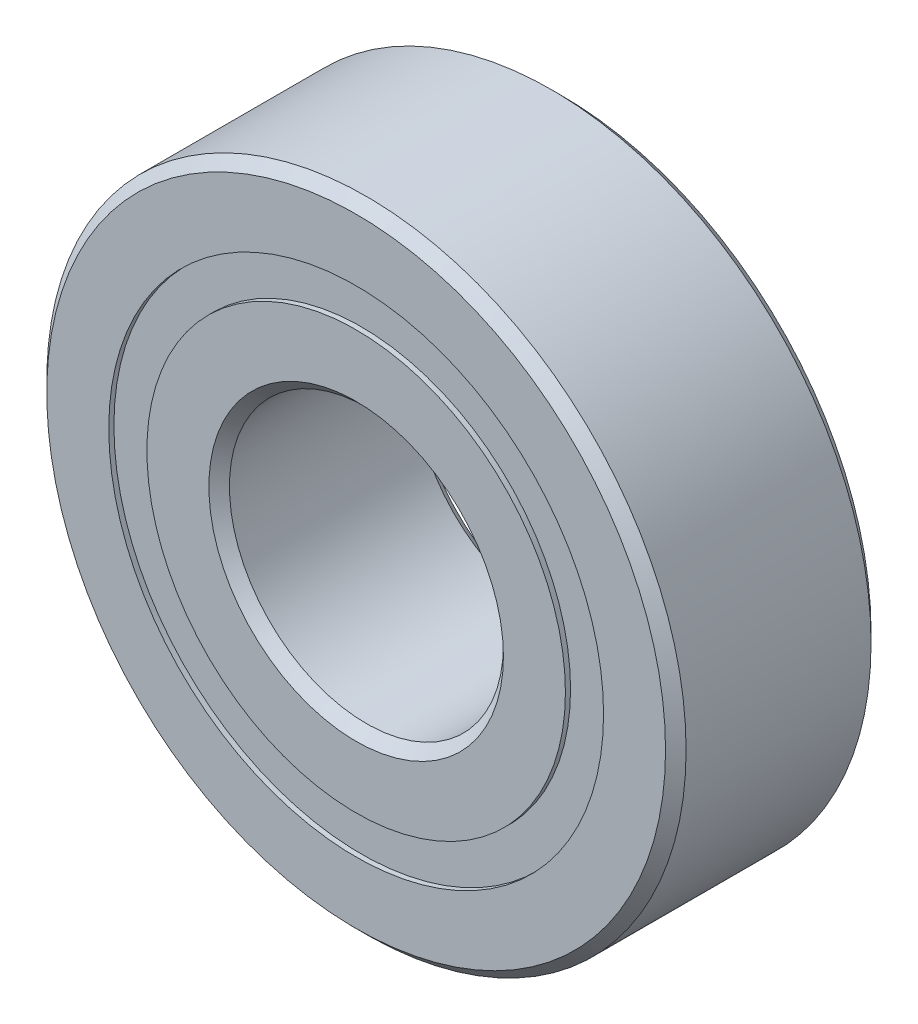
ISO-10303-21;
HEADER;
FILE_DESCRIPTION(('STEP AP214'),'2;1');
FILE_NAME('part.step','',(''),(''),'','','');
FILE_SCHEMA(('AUTOMOTIVE_DESIGN { 1 0 10303 214 1 1 1 1 }'));
ENDSEC;
DATA;
#1=APPLICATION_CONTEXT('core data for automotive mechanical design processes');
#2=APPLICATION_PROTOCOL_DEFINITION('international standard','automotive_design',2000,#1);
#3=PRODUCT_CONTEXT('',#1,'mechanical');
#4=PRODUCT('Part','Part','',(#3));
#5=PRODUCT_RELATED_PRODUCT_CATEGORY('part','',(#4));
#6=PRODUCT_DEFINITION_FORMATION('','',#4);
#7=PRODUCT_DEFINITION_CONTEXT('part definition',#1,'design');
#8=PRODUCT_DEFINITION('design','',#6,#7);
#9=PRODUCT_DEFINITION_SHAPE('','',#8);
#10=(LENGTH_UNIT() NAMED_UNIT(*) SI_UNIT(.MILLI.,.METRE.));
#11=(NAMED_UNIT(*) PLANE_ANGLE_UNIT() SI_UNIT($,.RADIAN.));
#12=(NAMED_UNIT(*) SI_UNIT($,.STERADIAN.) SOLID_ANGLE_UNIT());
#13=UNCERTAINTY_MEASURE_WITH_UNIT(LENGTH_MEASURE(1.E-05),#10,'distance_accuracy_value','');
#14=(GEOMETRIC_REPRESENTATION_CONTEXT(3) GLOBAL_UNCERTAINTY_ASSIGNED_CONTEXT((#13)) GLOBAL_UNIT_ASSIGNED_CONTEXT((#10,
#11,#12)) REPRESENTATION_CONTEXT('',''));
#15=CARTESIAN_POINT('',(0.,0.,0.));
#16=DIRECTION('',(0.,0.,1.));
#17=DIRECTION('',(1.,0.,0.));
#18=AXIS2_PLACEMENT_3D('',#15,#16,#17);
#19=CARTESIAN_POINT('',(0.,8.60041208791209,-3.39328125));
#20=DIRECTION('',(0.,0.,1.));
#21=DIRECTION('',(1.,0.,0.));
#22=AXIS2_PLACEMENT_3D('',#19,#20,#21);
#23=PLANE('',#22);
#24=CARTESIAN_POINT('',(0.,0.,-3.39328125));
#25=DIRECTION('',(0.,0.,1.));
#26=DIRECTION('',(1.,0.,0.));
#27=AXIS2_PLACEMENT_3D('',#24,#25,#26);
#28=CIRCLE('',#27,8.60041208791209);
#29=CARTESIAN_POINT('',(8.60041208791209,0.,-3.39328125));
#30=VERTEX_POINT('',#29);
#31=EDGE_CURVE('E67',#30,#30,#28,.T.);
#32=ORIENTED_EDGE('',*,*,#31,.F.);
#33=EDGE_LOOP('',(#32));
#34=FACE_BOUND('',#33,.T.);
#35=CARTESIAN_POINT('',(0.,0.,-3.39328125));
#36=DIRECTION('',(0.,0.,1.));
#37=DIRECTION('',(1.,0.,0.));
#38=AXIS2_PLACEMENT_3D('',#35,#36,#37);
#39=CIRCLE('',#38,7.27458791208791);
#40=CARTESIAN_POINT('',(7.27458791208791,0.,-3.39328125));
#41=VERTEX_POINT('',#40);
#42=EDGE_CURVE('E13',#41,#41,#39,.T.);
#43=ORIENTED_EDGE('',*,*,#42,.T.);
#44=EDGE_LOOP('',(#43));
#45=FACE_BOUND('',#44,.T.);
#46=ADVANCED_FACE('F53',(#34,#45),#23,.F.);
#47=CARTESIAN_POINT('',(0.,0.,3.571875));
#48=DIRECTION('',(0.,0.,1.));
#49=DIRECTION('',(1.,0.,0.));
#50=AXIS2_PLACEMENT_3D('',#47,#48,#49);
#51=CYLINDRICAL_SURFACE('',#50,7.27458791208791);
#52=ORIENTED_EDGE('',*,*,#42,.F.);
#53=EDGE_LOOP('',(#52));
#54=FACE_BOUND('',#53,.T.);
#55=CARTESIAN_POINT('',(0.,0.,-1.72035132641561));
#56=DIRECTION('',(0.,0.,1.));
#57=DIRECTION('',(1.,0.,0.));
#58=AXIS2_PLACEMENT_3D('',#55,#56,#57);
#59=CIRCLE('',#58,7.27458791208791);
#60=CARTESIAN_POINT('',(7.27458791208791,0.,-1.72035132641561));
#61=VERTEX_POINT('',#60);
#62=EDGE_CURVE('E59',#61,#61,#59,.T.);
#63=ORIENTED_EDGE('',*,*,#62,.T.);
#64=EDGE_LOOP('',(#63));
#65=FACE_BOUND('',#64,.T.);
#66=ADVANCED_FACE('F76',(#54,#65),#51,.F.);
#67=CARTESIAN_POINT('',(0.,8.60041208791209,-1.72035132641561));
#68=DIRECTION('',(0.,0.,-1.));
#69=DIRECTION('',(-1.,0.,0.));
#70=AXIS2_PLACEMENT_3D('',#67,#68,#69);
#71=PLANE('',#70);
#72=ORIENTED_EDGE('',*,*,#62,.F.);
#73=EDGE_LOOP('',(#72));
#74=FACE_BOUND('',#73,.T.);
#75=CARTESIAN_POINT('',(0.,0.,-1.72035132641561));
#76=DIRECTION('',(0.,0.,1.));
#77=DIRECTION('',(1.,0.,0.));
#78=AXIS2_PLACEMENT_3D('',#75,#76,#77);
#79=CIRCLE('',#78,8.60041208791209);
#80=CARTESIAN_POINT('',(8.60041208791209,0.,-1.72035132641561));
#81=VERTEX_POINT('',#80);
#82=EDGE_CURVE('E63',#81,#81,#79,.T.);
#83=ORIENTED_EDGE('',*,*,#82,.T.);
#84=EDGE_LOOP('',(#83));
#85=FACE_BOUND('',#84,.T.);
#86=ADVANCED_FACE('F80',(#74,#85),#71,.F.);
#87=CARTESIAN_POINT('',(0.,0.,3.571875));
#88=DIRECTION('',(0.,0.,1.));
#89=DIRECTION('',(1.,0.,0.));
#90=AXIS2_PLACEMENT_3D('',#87,#88,#89);
#91=CYLINDRICAL_SURFACE('',#90,8.60041208791209);
#92=ORIENTED_EDGE('',*,*,#82,.F.);
#93=EDGE_LOOP('',(#92));
#94=FACE_BOUND('',#93,.T.);
#95=ORIENTED_EDGE('',*,*,#31,.T.);
#96=EDGE_LOOP('',(#95));
#97=FACE_BOUND('',#96,.T.);
#98=ADVANCED_FACE('F73',(#94,#97),#91,.T.);
#99=CLOSED_SHELL('',(#46,#66,#86,#98));
#100=MANIFOLD_SOLID_BREP('B2',#99);
#101=CARTESIAN_POINT('',(0.,8.60041208791209,3.39328125));
#102=DIRECTION('',(0.,0.,-1.));
#103=DIRECTION('',(-1.,0.,0.));
#104=AXIS2_PLACEMENT_3D('',#101,#102,#103);
#105=PLANE('',#104);
#106=CARTESIAN_POINT('',(0.,0.,3.39328125));
#107=DIRECTION('',(0.,0.,1.));
#108=DIRECTION('',(1.,0.,0.));
#109=AXIS2_PLACEMENT_3D('',#106,#107,#108);
#110=CIRCLE('',#109,7.27458791208791);
#111=CARTESIAN_POINT('',(7.27458791208791,0.,3.39328125));
#112=VERTEX_POINT('',#111);
#113=EDGE_CURVE('E52',#112,#112,#110,.T.);
#114=ORIENTED_EDGE('',*,*,#113,.F.);
#115=EDGE_LOOP('',(#114));
#116=FACE_BOUND('',#115,.T.);
#117=CARTESIAN_POINT('',(0.,0.,3.39328125));
#118=DIRECTION('',(0.,0.,1.));
#119=DIRECTION('',(1.,0.,0.));
#120=AXIS2_PLACEMENT_3D('',#117,#118,#119);
#121=CIRCLE('',#120,8.60041208791209);
#122=CARTESIAN_POINT('',(8.60041208791209,0.,3.39328125));
#123=VERTEX_POINT('',#122);
#124=EDGE_CURVE('E140',#123,#123,#121,.T.);
#125=ORIENTED_EDGE('',*,*,#124,.T.);
#126=EDGE_LOOP('',(#125));
#127=FACE_BOUND('',#126,.T.);
#128=ADVANCED_FACE('F126',(#116,#127),#105,.F.);
#129=CARTESIAN_POINT('',(0.,0.,3.571875));
#130=DIRECTION('',(0.,0.,1.));
#131=DIRECTION('',(1.,0.,0.));
#132=AXIS2_PLACEMENT_3D('',#129,#130,#131);
#133=CYLINDRICAL_SURFACE('',#132,7.27458791208791);
#134=CARTESIAN_POINT('',(0.,0.,1.72035132641561));
#135=DIRECTION('',(0.,0.,1.));
#136=DIRECTION('',(1.,0.,0.));
#137=AXIS2_PLACEMENT_3D('',#134,#135,#136);
#138=CIRCLE('',#137,7.27458791208791);
#139=CARTESIAN_POINT('',(7.27458791208791,0.,1.72035132641561));
#140=VERTEX_POINT('',#139);
#141=EDGE_CURVE('E132',#140,#140,#138,.T.);
#142=ORIENTED_EDGE('',*,*,#141,.F.);
#143=EDGE_LOOP('',(#142));
#144=FACE_BOUND('',#143,.T.);
#145=ORIENTED_EDGE('',*,*,#113,.T.);
#146=EDGE_LOOP('',(#145));
#147=FACE_BOUND('',#146,.T.);
#148=ADVANCED_FACE('F155',(#144,#147),#133,.F.);
#149=CARTESIAN_POINT('',(0.,8.60041208791209,1.72035132641561));
#150=DIRECTION('',(0.,0.,1.));
#151=DIRECTION('',(1.,0.,0.));
#152=AXIS2_PLACEMENT_3D('',#149,#150,#151);
#153=PLANE('',#152);
#154=CARTESIAN_POINT('',(0.,0.,1.72035132641561));
#155=DIRECTION('',(0.,0.,1.));
#156=DIRECTION('',(1.,0.,0.));
#157=AXIS2_PLACEMENT_3D('',#154,#155,#156);
#158=CIRCLE('',#157,8.60041208791209);
#159=CARTESIAN_POINT('',(8.60041208791209,0.,1.72035132641561));
#160=VERTEX_POINT('',#159);
#161=EDGE_CURVE('E136',#160,#160,#158,.T.);
#162=ORIENTED_EDGE('',*,*,#161,.F.);
#163=EDGE_LOOP('',(#162));
#164=FACE_BOUND('',#163,.T.);
#165=ORIENTED_EDGE('',*,*,#141,.T.);
#166=EDGE_LOOP('',(#165));
#167=FACE_BOUND('',#166,.T.);
#168=ADVANCED_FACE('F150',(#164,#167),#153,.F.);
#169=CARTESIAN_POINT('',(0.,0.,3.571875));
#170=DIRECTION('',(0.,0.,1.));
#171=DIRECTION('',(1.,0.,0.));
#172=AXIS2_PLACEMENT_3D('',#169,#170,#171);
#173=CYLINDRICAL_SURFACE('',#172,8.60041208791209);
#174=ORIENTED_EDGE('',*,*,#124,.F.);
#175=EDGE_LOOP('',(#174));
#176=FACE_BOUND('',#175,.T.);
#177=ORIENTED_EDGE('',*,*,#161,.T.);
#178=EDGE_LOOP('',(#177));
#179=FACE_BOUND('',#178,.T.);
#180=ADVANCED_FACE('F147',(#176,#179),#173,.T.);
#181=CLOSED_SHELL('',(#128,#148,#168,#180));
#182=MANIFOLD_SOLID_BREP('B8',#181);
#183=CARTESIAN_POINT('',(-4.66554544007142,6.42157239285121,0.));
#184=DIRECTION('',(0.,0.,1.));
#185=DIRECTION('',(-0.587785252292462,0.809016994374955,0.));
#186=AXIS2_PLACEMENT_3D('',#183,#184,#185);
#187=SPHERICAL_SURFACE('',#186,1.72035132641561);
#188=CARTESIAN_POINT('',(-4.66554544007142,6.42157239285121,1.72035132641561));
#189=VERTEX_POINT('',#188);
#190=VERTEX_LOOP('',#189);
#191=FACE_BOUND('',#190,.T.);
#192=ADVANCED_FACE('F193',(#191),#187,.T.);
#193=CLOSED_SHELL('',(#192));
#194=MANIFOLD_SOLID_BREP('B47',#193);
#195=CARTESIAN_POINT('',(-7.54901109809275,2.45282239285123,0.));
#196=DIRECTION('',(0.,0.,1.));
#197=DIRECTION('',(-0.95105651629515,0.309016994374958,0.));
#198=AXIS2_PLACEMENT_3D('',#195,#196,#197);
#199=SPHERICAL_SURFACE('',#198,1.72035132641561);
#200=CARTESIAN_POINT('',(-7.54901109809275,2.45282239285123,1.72035132641561));
#201=VERTEX_POINT('',#200);
#202=VERTEX_LOOP('',#201);
#203=FACE_BOUND('',#202,.T.);
#204=ADVANCED_FACE('F213',(#203),#199,.T.);
#205=CLOSED_SHELL('',(#204));
#206=MANIFOLD_SOLID_BREP('B122',#205);
#207=CARTESIAN_POINT('',(-7.54901109809281,-2.45282239285107,0.));
#208=DIRECTION('',(0.,0.,1.));
#209=DIRECTION('',(-0.951056516295157,-0.309016994374938,0.));
#210=AXIS2_PLACEMENT_3D('',#207,#208,#209);
#211=SPHERICAL_SURFACE('',#210,1.72035132641561);
#212=CARTESIAN_POINT('',(-7.54901109809281,-2.45282239285107,1.72035132641561));
#213=VERTEX_POINT('',#212);
#214=VERTEX_LOOP('',#213);
#215=FACE_BOUND('',#214,.T.);
#216=ADVANCED_FACE('F233',(#215),#211,.T.);
#217=CLOSED_SHELL('',(#216));
#218=MANIFOLD_SOLID_BREP('B189',#217);
#219=CARTESIAN_POINT('',(-4.66554544007156,-6.4215723928511,0.));
#220=DIRECTION('',(0.,0.,1.));
#221=DIRECTION('',(-0.58778525229248,-0.809016994374942,0.));
#222=AXIS2_PLACEMENT_3D('',#219,#220,#221);
#223=SPHERICAL_SURFACE('',#222,1.72035132641561);
#224=CARTESIAN_POINT('',(-4.66554544007156,-6.4215723928511,1.72035132641561));
#225=VERTEX_POINT('',#224);
#226=VERTEX_LOOP('',#225);
#227=FACE_BOUND('',#226,.T.);
#228=ADVANCED_FACE('F253',(#227),#223,.T.);
#229=CLOSED_SHELL('',(#228));
#230=MANIFOLD_SOLID_BREP('B209',#229);
#231=CARTESIAN_POINT('',(0.,-7.9375,0.));
#232=DIRECTION('',(0.,0.,1.));
#233=DIRECTION('',(0.,-1.,0.));
#234=AXIS2_PLACEMENT_3D('',#231,#232,#233);
#235=SPHERICAL_SURFACE('',#234,1.72035132641561);
#236=CARTESIAN_POINT('',(0.,-7.9375,1.72035132641561));
#237=VERTEX_POINT('',#236);
#238=VERTEX_LOOP('',#237);
#239=FACE_BOUND('',#238,.T.);
#240=ADVANCED_FACE('F273',(#239),#235,.T.);
#241=CLOSED_SHELL('',(#240));
#242=MANIFOLD_SOLID_BREP('B229',#241);
#243=CARTESIAN_POINT('',(4.66554544007147,-6.42157239285117,0.));
#244=DIRECTION('',(0.,0.,1.));
#245=DIRECTION('',(0.587785252292469,-0.809016994374951,0.));
#246=AXIS2_PLACEMENT_3D('',#243,#244,#245);
#247=SPHERICAL_SURFACE('',#246,1.72035132641561);
#248=CARTESIAN_POINT('',(4.66554544007147,-6.42157239285117,1.72035132641561));
#249=VERTEX_POINT('',#248);
#250=VERTEX_LOOP('',#249);
#251=FACE_BOUND('',#250,.T.);
#252=ADVANCED_FACE('F293',(#251),#247,.T.);
#253=CLOSED_SHELL('',(#252));
#254=MANIFOLD_SOLID_BREP('B249',#253);
#255=CARTESIAN_POINT('',(7.54901109809277,-2.45282239285118,0.));
#256=DIRECTION('',(0.,0.,1.));
#257=DIRECTION('',(0.951056516295152,-0.309016994374952,0.));
#258=AXIS2_PLACEMENT_3D('',#255,#256,#257);
#259=SPHERICAL_SURFACE('',#258,1.72035132641561);
#260=CARTESIAN_POINT('',(7.54901109809277,-2.45282239285118,1.72035132641561));
#261=VERTEX_POINT('',#260);
#262=VERTEX_LOOP('',#261);
#263=FACE_BOUND('',#262,.T.);
#264=ADVANCED_FACE('F313',(#263),#259,.T.);
#265=CLOSED_SHELL('',(#264));
#266=MANIFOLD_SOLID_BREP('B269',#265);
#267=CARTESIAN_POINT('',(7.54901109809279,2.45282239285112,0.));
#268=DIRECTION('',(0.,0.,1.));
#269=DIRECTION('',(0.951056516295155,0.309016994374945,0.));
#270=AXIS2_PLACEMENT_3D('',#267,#268,#269);
#271=SPHERICAL_SURFACE('',#270,1.72035132641561);
#272=CARTESIAN_POINT('',(7.54901109809279,2.45282239285112,1.72035132641561));
#273=VERTEX_POINT('',#272);
#274=VERTEX_LOOP('',#273);
#275=FACE_BOUND('',#274,.T.);
#276=ADVANCED_FACE('F333',(#275),#271,.T.);
#277=CLOSED_SHELL('',(#276));
#278=MANIFOLD_SOLID_BREP('B289',#277);
#279=CARTESIAN_POINT('',(4.66554544007152,6.42157239285114,0.));
#280=DIRECTION('',(0.,0.,1.));
#281=DIRECTION('',(0.587785252292474,0.809016994374947,0.));
#282=AXIS2_PLACEMENT_3D('',#279,#280,#281);
#283=SPHERICAL_SURFACE('',#282,1.72035132641561);
#284=CARTESIAN_POINT('',(4.66554544007152,6.42157239285114,1.72035132641561));
#285=VERTEX_POINT('',#284);
#286=VERTEX_LOOP('',#285);
#287=FACE_BOUND('',#286,.T.);
#288=ADVANCED_FACE('F353',(#287),#283,.T.);
#289=CLOSED_SHELL('',(#288));
#290=MANIFOLD_SOLID_BREP('B309',#289);
#291=CARTESIAN_POINT('',(0.,7.9375,0.));
#292=DIRECTION('',(0.,0.,1.));
#293=DIRECTION('',(0.,1.,0.));
#294=AXIS2_PLACEMENT_3D('',#291,#292,#293);
#295=SPHERICAL_SURFACE('',#294,1.72035132641561);
#296=CARTESIAN_POINT('',(0.,7.9375,1.72035132641561));
#297=VERTEX_POINT('',#296);
#298=VERTEX_LOOP('',#297);
#299=FACE_BOUND('',#298,.T.);
#300=ADVANCED_FACE('F377',(#299),#295,.T.);
#301=CLOSED_SHELL('',(#300));
#302=MANIFOLD_SOLID_BREP('B329',#301);
#303=CARTESIAN_POINT('',(0.,7.27458791208791,3.571875));
#304=DIRECTION('',(0.,0.,-1.));
#305=DIRECTION('',(-1.,0.,0.));
#306=AXIS2_PLACEMENT_3D('',#303,#304,#305);
#307=PLANE('',#306);
#308=CARTESIAN_POINT('',(0.,0.,3.571875));
#309=DIRECTION('',(0.,0.,1.));
#310=DIRECTION('',(1.,0.,0.));
#311=AXIS2_PLACEMENT_3D('',#308,#309,#310);
#312=CIRCLE('',#311,5.1196875);
#313=CARTESIAN_POINT('',(5.1196875,0.,3.571875));
#314=VERTEX_POINT('',#313);
#315=EDGE_CURVE('E432',#314,#314,#312,.T.);
#316=ORIENTED_EDGE('',*,*,#315,.F.);
#317=EDGE_LOOP('',(#316));
#318=FACE_BOUND('',#317,.T.);
#319=CARTESIAN_POINT('',(0.,0.,3.571875));
#320=DIRECTION('',(0.,0.,1.));
#321=DIRECTION('',(1.,0.,0.));
#322=AXIS2_PLACEMENT_3D('',#319,#320,#321);
#323=CIRCLE('',#322,7.27458791208791);
#324=CARTESIAN_POINT('',(7.27458791208791,0.,3.571875));
#325=VERTEX_POINT('',#324);
#326=EDGE_CURVE('E376',#325,#325,#323,.T.);
#327=ORIENTED_EDGE('',*,*,#326,.T.);
#328=EDGE_LOOP('',(#327));
#329=FACE_BOUND('',#328,.T.);
#330=ADVANCED_FACE('F404',(#318,#329),#307,.F.);
#331=CARTESIAN_POINT('',(0.,0.,3.571875));
#332=DIRECTION('',(0.,0.,1.));
#333=DIRECTION('',(1.,0.,0.));
#334=AXIS2_PLACEMENT_3D('',#331,#332,#333);
#335=CYLINDRICAL_SURFACE('',#334,7.27458791208791);
#336=ORIENTED_EDGE('',*,*,#326,.F.);
#337=EDGE_LOOP('',(#336));
#338=FACE_BOUND('',#337,.T.);
#339=CARTESIAN_POINT('',(0.,0.,1.5875));
#340=DIRECTION('',(0.,0.,1.));
#341=DIRECTION('',(1.,0.,0.));
#342=AXIS2_PLACEMENT_3D('',#339,#340,#341);
#343=CIRCLE('',#342,7.27458791208791);
#344=CARTESIAN_POINT('',(7.27458791208791,0.,1.5875));
#345=VERTEX_POINT('',#344);
#346=EDGE_CURVE('E410',#345,#345,#343,.T.);
#347=ORIENTED_EDGE('',*,*,#346,.T.);
#348=EDGE_LOOP('',(#347));
#349=FACE_BOUND('',#348,.T.);
#350=ADVANCED_FACE('F439',(#338,#349),#335,.T.);
#351=CARTESIAN_POINT('',(0.,0.,0.));
#352=DIRECTION('',(0.,0.,1.));
#353=DIRECTION('',(1.,0.,0.));
#354=AXIS2_PLACEMENT_3D('',#351,#352,#353);
#355=TOROIDAL_SURFACE('',#354,7.93749999999999,1.72035132641561);
#356=ORIENTED_EDGE('',*,*,#346,.F.);
#357=EDGE_LOOP('',(#356));
#358=FACE_BOUND('',#357,.T.);
#359=CARTESIAN_POINT('',(0.,0.,-1.5875));
#360=DIRECTION('',(0.,0.,1.));
#361=DIRECTION('',(1.,0.,0.));
#362=AXIS2_PLACEMENT_3D('',#359,#360,#361);
#363=CIRCLE('',#362,7.27458791208791);
#364=CARTESIAN_POINT('',(7.27458791208791,0.,-1.5875));
#365=VERTEX_POINT('',#364);
#366=EDGE_CURVE('E414',#365,#365,#363,.T.);
#367=ORIENTED_EDGE('',*,*,#366,.T.);
#368=EDGE_LOOP('',(#367));
#369=FACE_BOUND('',#368,.T.);
#370=ADVANCED_FACE('F443',(#358,#369),#355,.F.);
#371=CARTESIAN_POINT('',(0.,0.,3.571875));
#372=DIRECTION('',(0.,0.,1.));
#373=DIRECTION('',(1.,0.,0.));
#374=AXIS2_PLACEMENT_3D('',#371,#372,#373);
#375=CYLINDRICAL_SURFACE('',#374,7.27458791208791);
#376=ORIENTED_EDGE('',*,*,#366,.F.);
#377=EDGE_LOOP('',(#376));
#378=FACE_BOUND('',#377,.T.);
#379=CARTESIAN_POINT('',(0.,0.,-3.571875));
#380=DIRECTION('',(0.,0.,1.));
#381=DIRECTION('',(1.,0.,0.));
#382=AXIS2_PLACEMENT_3D('',#379,#380,#381);
#383=CIRCLE('',#382,7.27458791208791);
#384=CARTESIAN_POINT('',(7.27458791208791,0.,-3.571875));
#385=VERTEX_POINT('',#384);
#386=EDGE_CURVE('E418',#385,#385,#383,.T.);
#387=ORIENTED_EDGE('',*,*,#386,.T.);
#388=EDGE_LOOP('',(#387));
#389=FACE_BOUND('',#388,.T.);
#390=ADVANCED_FACE('F448',(#378,#389),#375,.T.);
#391=CARTESIAN_POINT('',(0.,5.1196875,-3.571875));
#392=DIRECTION('',(0.,0.,1.));
#393=DIRECTION('',(1.,0.,0.));
#394=AXIS2_PLACEMENT_3D('',#391,#392,#393);
#395=PLANE('',#394);
#396=ORIENTED_EDGE('',*,*,#386,.F.);
#397=EDGE_LOOP('',(#396));
#398=FACE_BOUND('',#397,.T.);
#399=CARTESIAN_POINT('',(0.,0.,-3.571875));
#400=DIRECTION('',(0.,0.,1.));
#401=DIRECTION('',(1.,0.,0.));
#402=AXIS2_PLACEMENT_3D('',#399,#400,#401);
#403=CIRCLE('',#402,5.1196875);
#404=CARTESIAN_POINT('',(5.1196875,0.,-3.571875));
#405=VERTEX_POINT('',#404);
#406=EDGE_CURVE('E423',#405,#405,#403,.T.);
#407=ORIENTED_EDGE('',*,*,#406,.T.);
#408=EDGE_LOOP('',(#407));
#409=FACE_BOUND('',#408,.T.);
#410=ADVANCED_FACE('F454',(#398,#409),#395,.F.);
#411=CARTESIAN_POINT('',(0.,0.,-3.2146875));
#412=DIRECTION('',(0.,0.,-1.));
#413=DIRECTION('',(-1.,0.,0.));
#414=AXIS2_PLACEMENT_3D('',#411,#412,#413);
#415=CONICAL_SURFACE('',#414,4.7625,0.785398163397445);
#416=ORIENTED_EDGE('',*,*,#406,.F.);
#417=EDGE_LOOP('',(#416));
#418=FACE_BOUND('',#417,.T.);
#419=CARTESIAN_POINT('',(0.,0.,-3.2146875));
#420=DIRECTION('',(0.,0.,1.));
#421=DIRECTION('',(1.,0.,0.));
#422=AXIS2_PLACEMENT_3D('',#419,#420,#421);
#423=CIRCLE('',#422,4.7625);
#424=CARTESIAN_POINT('',(4.7625,0.,-3.2146875));
#425=VERTEX_POINT('',#424);
#426=EDGE_CURVE('E426',#425,#425,#423,.T.);
#427=ORIENTED_EDGE('',*,*,#426,.T.);
#428=EDGE_LOOP('',(#427));
#429=FACE_BOUND('',#428,.T.);
#430=ADVANCED_FACE('F458',(#418,#429),#415,.F.);
#431=CARTESIAN_POINT('',(0.,0.,3.571875));
#432=DIRECTION('',(0.,0.,1.));
#433=DIRECTION('',(1.,0.,0.));
#434=AXIS2_PLACEMENT_3D('',#431,#432,#433);
#435=CYLINDRICAL_SURFACE('',#434,4.7625);
#436=ORIENTED_EDGE('',*,*,#426,.F.);
#437=EDGE_LOOP('',(#436));
#438=FACE_BOUND('',#437,.T.);
#439=CARTESIAN_POINT('',(0.,0.,3.2146875));
#440=DIRECTION('',(0.,0.,1.));
#441=DIRECTION('',(1.,0.,0.));
#442=AXIS2_PLACEMENT_3D('',#439,#440,#441);
#443=CIRCLE('',#442,4.7625);
#444=CARTESIAN_POINT('',(4.7625,0.,3.2146875));
#445=VERTEX_POINT('',#444);
#446=EDGE_CURVE('E429',#445,#445,#443,.T.);
#447=ORIENTED_EDGE('',*,*,#446,.T.);
#448=EDGE_LOOP('',(#447));
#449=FACE_BOUND('',#448,.T.);
#450=ADVANCED_FACE('F462',(#438,#449),#435,.F.);
#451=CARTESIAN_POINT('',(0.,0.,3.571875));
#452=DIRECTION('',(0.,0.,1.));
#453=DIRECTION('',(1.,0.,0.));
#454=AXIS2_PLACEMENT_3D('',#451,#452,#453);
#455=CONICAL_SURFACE('',#454,5.1196875,0.785398163397451);
#456=ORIENTED_EDGE('',*,*,#446,.F.);
#457=EDGE_LOOP('',(#456));
#458=FACE_BOUND('',#457,.T.);
#459=ORIENTED_EDGE('',*,*,#315,.T.);
#460=EDGE_LOOP('',(#459));
#461=FACE_BOUND('',#460,.T.);
#462=ADVANCED_FACE('F436',(#458,#461),#455,.F.);
#463=CLOSED_SHELL('',(#330,#350,#370,#390,#410,#430,#450,#462));
#464=MANIFOLD_SOLID_BREP('B349',#463);
#465=CARTESIAN_POINT('',(0.,0.,3.2146875));
#466=DIRECTION('',(0.,0.,-1.));
#467=DIRECTION('',(-1.,0.,0.));
#468=AXIS2_PLACEMENT_3D('',#465,#466,#467);
#469=CONICAL_SURFACE('',#468,11.1125,0.785398163397446);
#470=CARTESIAN_POINT('',(0.,0.,3.571875));
#471=DIRECTION('',(0.,0.,1.));
#472=DIRECTION('',(1.,0.,0.));
#473=AXIS2_PLACEMENT_3D('',#470,#471,#472);
#474=CIRCLE('',#473,10.7553125);
#475=CARTESIAN_POINT('',(10.7553125,0.,3.571875));
#476=VERTEX_POINT('',#475);
#477=EDGE_CURVE('E559',#476,#476,#474,.T.);
#478=ORIENTED_EDGE('',*,*,#477,.F.);
#479=EDGE_LOOP('',(#478));
#480=FACE_BOUND('',#479,.T.);
#481=CARTESIAN_POINT('',(0.,0.,3.2146875));
#482=DIRECTION('',(0.,0.,1.));
#483=DIRECTION('',(1.,0.,0.));
#484=AXIS2_PLACEMENT_3D('',#481,#482,#483);
#485=CIRCLE('',#484,11.1125);
#486=CARTESIAN_POINT('',(11.1125,0.,3.2146875));
#487=VERTEX_POINT('',#486);
#488=EDGE_CURVE('E403',#487,#487,#485,.T.);
#489=ORIENTED_EDGE('',*,*,#488,.T.);
#490=EDGE_LOOP('',(#489));
#491=FACE_BOUND('',#490,.T.);
#492=ADVANCED_FACE('F531',(#480,#491),#469,.T.);
#493=CARTESIAN_POINT('',(0.,0.,3.571875));
#494=DIRECTION('',(0.,0.,1.));
#495=DIRECTION('',(1.,0.,0.));
#496=AXIS2_PLACEMENT_3D('',#493,#494,#495);
#497=CYLINDRICAL_SURFACE('',#496,11.1125);
#498=ORIENTED_EDGE('',*,*,#488,.F.);
#499=EDGE_LOOP('',(#498));
#500=FACE_BOUND('',#499,.T.);
#501=CARTESIAN_POINT('',(0.,0.,-3.2146875));
#502=DIRECTION('',(0.,0.,1.));
#503=DIRECTION('',(1.,0.,0.));
#504=AXIS2_PLACEMENT_3D('',#501,#502,#503);
#505=CIRCLE('',#504,11.1125);
#506=CARTESIAN_POINT('',(11.1125,0.,-3.2146875));
#507=VERTEX_POINT('',#506);
#508=EDGE_CURVE('E537',#507,#507,#505,.T.);
#509=ORIENTED_EDGE('',*,*,#508,.T.);
#510=EDGE_LOOP('',(#509));
#511=FACE_BOUND('',#510,.T.);
#512=ADVANCED_FACE('F566',(#500,#511),#497,.T.);
#513=CARTESIAN_POINT('',(0.,0.,-3.571875));
#514=DIRECTION('',(0.,0.,1.));
#515=DIRECTION('',(1.,0.,0.));
#516=AXIS2_PLACEMENT_3D('',#513,#514,#515);
#517=CONICAL_SURFACE('',#516,10.7553125,0.785398163397444);
#518=ORIENTED_EDGE('',*,*,#508,.F.);
#519=EDGE_LOOP('',(#518));
#520=FACE_BOUND('',#519,.T.);
#521=CARTESIAN_POINT('',(0.,0.,-3.571875));
#522=DIRECTION('',(0.,0.,1.));
#523=DIRECTION('',(1.,0.,0.));
#524=AXIS2_PLACEMENT_3D('',#521,#522,#523);
#525=CIRCLE('',#524,10.7553125);
#526=CARTESIAN_POINT('',(10.7553125,0.,-3.571875));
#527=VERTEX_POINT('',#526);
#528=EDGE_CURVE('E541',#527,#527,#525,.T.);
#529=ORIENTED_EDGE('',*,*,#528,.T.);
#530=EDGE_LOOP('',(#529));
#531=FACE_BOUND('',#530,.T.);
#532=ADVANCED_FACE('F570',(#520,#531),#517,.T.);
#533=CARTESIAN_POINT('',(0.,10.7553125,-3.571875));
#534=DIRECTION('',(0.,0.,1.));
#535=DIRECTION('',(1.,0.,0.));
#536=AXIS2_PLACEMENT_3D('',#533,#534,#535);
#537=PLANE('',#536);
#538=ORIENTED_EDGE('',*,*,#528,.F.);
#539=EDGE_LOOP('',(#538));
#540=FACE_BOUND('',#539,.T.);
#541=CARTESIAN_POINT('',(0.,0.,-3.571875));
#542=DIRECTION('',(0.,0.,1.));
#543=DIRECTION('',(1.,0.,0.));
#544=AXIS2_PLACEMENT_3D('',#541,#542,#543);
#545=CIRCLE('',#544,8.60041208791209);
#546=CARTESIAN_POINT('',(8.60041208791209,0.,-3.571875));
#547=VERTEX_POINT('',#546);
#548=EDGE_CURVE('E545',#547,#547,#545,.T.);
#549=ORIENTED_EDGE('',*,*,#548,.T.);
#550=EDGE_LOOP('',(#549));
#551=FACE_BOUND('',#550,.T.);
#552=ADVANCED_FACE('F575',(#540,#551),#537,.F.);
#553=CARTESIAN_POINT('',(0.,0.,3.571875));
#554=DIRECTION('',(0.,0.,1.));
#555=DIRECTION('',(1.,0.,0.));
#556=AXIS2_PLACEMENT_3D('',#553,#554,#555);
#557=CYLINDRICAL_SURFACE('',#556,8.60041208791209);
#558=ORIENTED_EDGE('',*,*,#548,.F.);
#559=EDGE_LOOP('',(#558));
#560=FACE_BOUND('',#559,.T.);
#561=CARTESIAN_POINT('',(0.,0.,-1.5875));
#562=DIRECTION('',(0.,0.,1.));
#563=DIRECTION('',(1.,0.,0.));
#564=AXIS2_PLACEMENT_3D('',#561,#562,#563);
#565=CIRCLE('',#564,8.60041208791209);
#566=CARTESIAN_POINT('',(8.60041208791209,0.,-1.5875));
#567=VERTEX_POINT('',#566);
#568=EDGE_CURVE('E550',#567,#567,#565,.T.);
#569=ORIENTED_EDGE('',*,*,#568,.T.);
#570=EDGE_LOOP('',(#569));
#571=FACE_BOUND('',#570,.T.);
#572=ADVANCED_FACE('F581',(#560,#571),#557,.F.);
#573=CARTESIAN_POINT('',(0.,0.,0.));
#574=DIRECTION('',(0.,0.,1.));
#575=DIRECTION('',(1.,0.,0.));
#576=AXIS2_PLACEMENT_3D('',#573,#574,#575);
#577=TOROIDAL_SURFACE('',#576,7.9375,1.72035132641561);
#578=ORIENTED_EDGE('',*,*,#568,.F.);
#579=EDGE_LOOP('',(#578));
#580=FACE_BOUND('',#579,.T.);
#581=CARTESIAN_POINT('',(0.,0.,1.5875));
#582=DIRECTION('',(0.,0.,1.));
#583=DIRECTION('',(1.,0.,0.));
#584=AXIS2_PLACEMENT_3D('',#581,#582,#583);
#585=CIRCLE('',#584,8.60041208791209);
#586=CARTESIAN_POINT('',(8.60041208791209,0.,1.5875));
#587=VERTEX_POINT('',#586);
#588=EDGE_CURVE('E553',#587,#587,#585,.T.);
#589=ORIENTED_EDGE('',*,*,#588,.T.);
#590=EDGE_LOOP('',(#589));
#591=FACE_BOUND('',#590,.T.);
#592=ADVANCED_FACE('F585',(#580,#591),#577,.F.);
#593=CARTESIAN_POINT('',(0.,0.,3.571875));
#594=DIRECTION('',(0.,0.,1.));
#595=DIRECTION('',(1.,0.,0.));
#596=AXIS2_PLACEMENT_3D('',#593,#594,#595);
#597=CYLINDRICAL_SURFACE('',#596,8.60041208791209);
#598=ORIENTED_EDGE('',*,*,#588,.F.);
#599=EDGE_LOOP('',(#598));
#600=FACE_BOUND('',#599,.T.);
#601=CARTESIAN_POINT('',(0.,0.,3.571875));
#602=DIRECTION('',(0.,0.,1.));
#603=DIRECTION('',(1.,0.,0.));
#604=AXIS2_PLACEMENT_3D('',#601,#602,#603);
#605=CIRCLE('',#604,8.60041208791209);
#606=CARTESIAN_POINT('',(8.60041208791209,0.,3.571875));
#607=VERTEX_POINT('',#606);
#608=EDGE_CURVE('E556',#607,#607,#605,.T.);
#609=ORIENTED_EDGE('',*,*,#608,.T.);
#610=EDGE_LOOP('',(#609));
#611=FACE_BOUND('',#610,.T.);
#612=ADVANCED_FACE('F589',(#600,#611),#597,.F.);
#613=CARTESIAN_POINT('',(0.,10.7553125,3.571875));
#614=DIRECTION('',(0.,0.,-1.));
#615=DIRECTION('',(-1.,0.,0.));
#616=AXIS2_PLACEMENT_3D('',#613,#614,#615);
#617=PLANE('',#616);
#618=ORIENTED_EDGE('',*,*,#608,.F.);
#619=EDGE_LOOP('',(#618));
#620=FACE_BOUND('',#619,.T.);
#621=ORIENTED_EDGE('',*,*,#477,.T.);
#622=EDGE_LOOP('',(#621));
#623=FACE_BOUND('',#622,.T.);
#624=ADVANCED_FACE('F563',(#620,#623),#617,.F.);
#625=CLOSED_SHELL('',(#492,#512,#532,#552,#572,#592,#612,#624));
#626=MANIFOLD_SOLID_BREP('B371',#625);
#627=ADVANCED_BREP_SHAPE_REPRESENTATION('',(#18,#100,#182,#194,#206,#218,#230,#242,#254,#266,
#278,#290,#302,#464,#626),#14);
#628=SHAPE_DEFINITION_REPRESENTATION(#9,#627);
ENDSEC;
END-ISO-10303-21;
